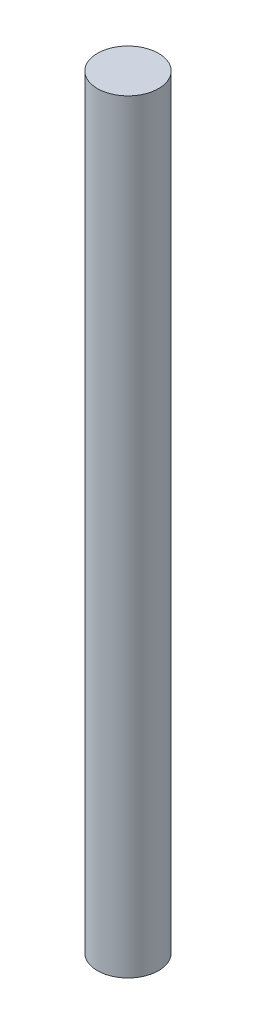
ISO-10303-21;
HEADER;
FILE_DESCRIPTION(('STEP AP214'),'2;1');
FILE_NAME('part.step','',(''),(''),'','','');
FILE_SCHEMA(('AUTOMOTIVE_DESIGN { 1 0 10303 214 1 1 1 1 }'));
ENDSEC;
DATA;
#1=APPLICATION_CONTEXT('core data for automotive mechanical design processes');
#2=APPLICATION_PROTOCOL_DEFINITION('international standard','automotive_design',2000,#1);
#3=PRODUCT_CONTEXT('',#1,'mechanical');
#4=PRODUCT('Part','Part','',(#3));
#5=PRODUCT_RELATED_PRODUCT_CATEGORY('part','',(#4));
#6=PRODUCT_DEFINITION_FORMATION('','',#4);
#7=PRODUCT_DEFINITION_CONTEXT('part definition',#1,'design');
#8=PRODUCT_DEFINITION('design','',#6,#7);
#9=PRODUCT_DEFINITION_SHAPE('','',#8);
#10=(LENGTH_UNIT() NAMED_UNIT(*) SI_UNIT(.MILLI.,.METRE.));
#11=(NAMED_UNIT(*) PLANE_ANGLE_UNIT() SI_UNIT($,.RADIAN.));
#12=(NAMED_UNIT(*) SI_UNIT($,.STERADIAN.) SOLID_ANGLE_UNIT());
#13=UNCERTAINTY_MEASURE_WITH_UNIT(LENGTH_MEASURE(1.E-05),#10,'distance_accuracy_value','');
#14=(GEOMETRIC_REPRESENTATION_CONTEXT(3) GLOBAL_UNCERTAINTY_ASSIGNED_CONTEXT((#13)) GLOBAL_UNIT_ASSIGNED_CONTEXT((#10,
#11,#12)) REPRESENTATION_CONTEXT('',''));
#15=CARTESIAN_POINT('',(0.,0.,0.));
#16=DIRECTION('',(0.,0.,1.));
#17=DIRECTION('',(1.,0.,0.));
#18=AXIS2_PLACEMENT_3D('',#15,#16,#17);
#19=CARTESIAN_POINT('',(0.,500.,0.));
#20=DIRECTION('',(0.,-1.,0.));
#21=DIRECTION('',(0.,0.,-1.));
#22=AXIS2_PLACEMENT_3D('',#19,#20,#21);
#23=CYLINDRICAL_SURFACE('',#22,20.);
#24=CARTESIAN_POINT('',(0.,500.,0.));
#25=DIRECTION('',(0.,1.,0.));
#26=DIRECTION('',(0.,0.,1.));
#27=AXIS2_PLACEMENT_3D('',#24,#25,#26);
#28=CIRCLE('',#27,20.);
#29=CARTESIAN_POINT('',(0.,500.,20.));
#30=VERTEX_POINT('',#29);
#31=EDGE_CURVE('E10',#30,#30,#28,.T.);
#32=ORIENTED_EDGE('',*,*,#31,.F.);
#33=EDGE_LOOP('',(#32));
#34=FACE_BOUND('',#33,.T.);
#35=CARTESIAN_POINT('',(0.,0.,0.));
#36=DIRECTION('',(0.,1.,0.));
#37=DIRECTION('',(0.,0.,1.));
#38=AXIS2_PLACEMENT_3D('',#35,#36,#37);
#39=CIRCLE('',#38,20.);
#40=CARTESIAN_POINT('',(0.,0.,20.));
#41=VERTEX_POINT('',#40);
#42=EDGE_CURVE('E40',#41,#41,#39,.T.);
#43=ORIENTED_EDGE('',*,*,#42,.T.);
#44=EDGE_LOOP('',(#43));
#45=FACE_BOUND('',#44,.T.);
#46=ADVANCED_FACE('F37',(#34,#45),#23,.T.);
#47=CARTESIAN_POINT('',(0.,500.,0.));
#48=DIRECTION('',(0.,1.,0.));
#49=DIRECTION('',(0.,0.,1.));
#50=AXIS2_PLACEMENT_3D('',#47,#48,#49);
#51=PLANE('',#50);
#52=ORIENTED_EDGE('',*,*,#31,.T.);
#53=EDGE_LOOP('',(#52));
#54=FACE_BOUND('',#53,.T.);
#55=ADVANCED_FACE('F54',(#54),#51,.T.);
#56=CARTESIAN_POINT('',(0.,0.,0.));
#57=DIRECTION('',(0.,1.,0.));
#58=DIRECTION('',(0.,0.,1.));
#59=AXIS2_PLACEMENT_3D('',#56,#57,#58);
#60=PLANE('',#59);
#61=ORIENTED_EDGE('',*,*,#42,.F.);
#62=EDGE_LOOP('',(#61));
#63=FACE_BOUND('',#62,.T.);
#64=ADVANCED_FACE('F52',(#63),#60,.F.);
#65=CLOSED_SHELL('',(#46,#55,#64));
#66=MANIFOLD_SOLID_BREP('B2',#65);
#67=ADVANCED_BREP_SHAPE_REPRESENTATION('',(#18,#66),#14);
#68=SHAPE_DEFINITION_REPRESENTATION(#9,#67);
ENDSEC;
END-ISO-10303-21;
